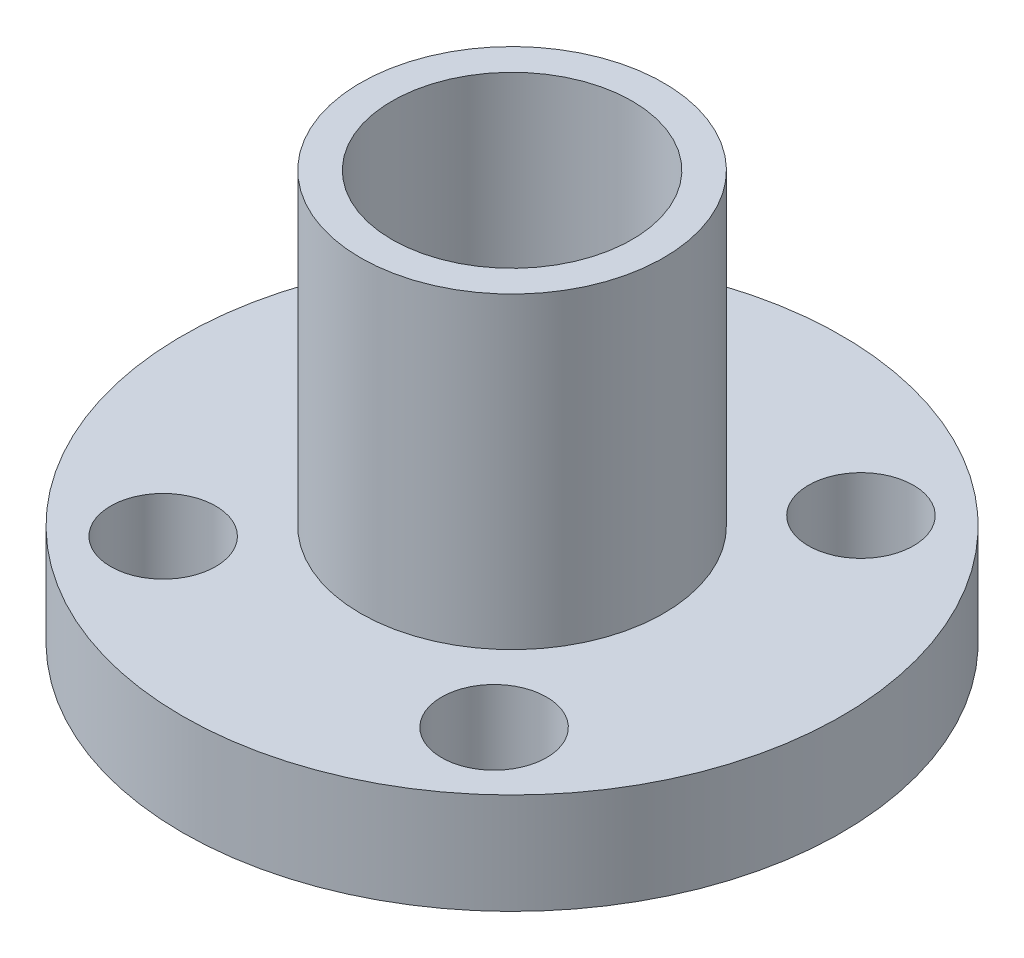
ISO-10303-21;
HEADER;
FILE_DESCRIPTION(('STEP AP214'),'2;1');
FILE_NAME('part.step','',(''),(''),'','','');
FILE_SCHEMA(('AUTOMOTIVE_DESIGN { 1 0 10303 214 1 1 1 1 }'));
ENDSEC;
DATA;
#1=APPLICATION_CONTEXT('core data for automotive mechanical design processes');
#2=APPLICATION_PROTOCOL_DEFINITION('international standard','automotive_design',2000,#1);
#3=PRODUCT_CONTEXT('',#1,'mechanical');
#4=PRODUCT('Part','Part','',(#3));
#5=PRODUCT_RELATED_PRODUCT_CATEGORY('part','',(#4));
#6=PRODUCT_DEFINITION_FORMATION('','',#4);
#7=PRODUCT_DEFINITION_CONTEXT('part definition',#1,'design');
#8=PRODUCT_DEFINITION('design','',#6,#7);
#9=PRODUCT_DEFINITION_SHAPE('','',#8);
#10=(LENGTH_UNIT() NAMED_UNIT(*) SI_UNIT(.MILLI.,.METRE.));
#11=(NAMED_UNIT(*) PLANE_ANGLE_UNIT() SI_UNIT($,.RADIAN.));
#12=(NAMED_UNIT(*) SI_UNIT($,.STERADIAN.) SOLID_ANGLE_UNIT());
#13=UNCERTAINTY_MEASURE_WITH_UNIT(LENGTH_MEASURE(1.E-05),#10,'distance_accuracy_value','');
#14=(GEOMETRIC_REPRESENTATION_CONTEXT(3) GLOBAL_UNCERTAINTY_ASSIGNED_CONTEXT((#13)) GLOBAL_UNIT_ASSIGNED_CONTEXT((#10,
#11,#12)) REPRESENTATION_CONTEXT('',''));
#15=CARTESIAN_POINT('',(0.,0.,0.));
#16=DIRECTION('',(0.,0.,1.));
#17=DIRECTION('',(1.,0.,0.));
#18=AXIS2_PLACEMENT_3D('',#15,#16,#17);
#19=CARTESIAN_POINT('',(0.,3.36,0.));
#20=DIRECTION('',(0.,1.,0.));
#21=DIRECTION('',(0.,0.,1.));
#22=AXIS2_PLACEMENT_3D('',#19,#20,#21);
#23=PLANE('',#22);
#24=CARTESIAN_POINT('',(0.,3.36,0.));
#25=DIRECTION('',(0.,1.,0.));
#26=DIRECTION('',(0.,0.,1.));
#27=AXIS2_PLACEMENT_3D('',#24,#25,#26);
#28=CIRCLE('',#27,5.05);
#29=CARTESIAN_POINT('',(0.,3.36,5.05));
#30=VERTEX_POINT('',#29);
#31=EDGE_CURVE('E72',#30,#30,#28,.T.);
#32=ORIENTED_EDGE('',*,*,#31,.F.);
#33=EDGE_LOOP('',(#32));
#34=FACE_BOUND('',#33,.T.);
#35=CARTESIAN_POINT('',(5.51209355793703,3.36,6.11144210547307));
#36=DIRECTION('',(0.,1.,0.));
#37=DIRECTION('',(0.,0.,-1.));
#38=AXIS2_PLACEMENT_3D('',#35,#36,#37);
#39=CIRCLE('',#38,1.75);
#40=CARTESIAN_POINT('',(5.51209355793703,3.36,4.36144210547307));
#41=VERTEX_POINT('',#40);
#42=EDGE_CURVE('E57',#41,#41,#39,.T.);
#43=ORIENTED_EDGE('',*,*,#42,.F.);
#44=EDGE_LOOP('',(#43));
#45=FACE_BOUND('',#44,.T.);
#46=CARTESIAN_POINT('',(-5.51209355793703,3.36,6.11144210547307));
#47=DIRECTION('',(0.,1.,0.));
#48=DIRECTION('',(0.,0.,1.));
#49=AXIS2_PLACEMENT_3D('',#46,#47,#48);
#50=CIRCLE('',#49,1.75);
#51=CARTESIAN_POINT('',(-5.51209355793703,3.36,7.86144210547307));
#52=VERTEX_POINT('',#51);
#53=EDGE_CURVE('E46',#52,#52,#50,.T.);
#54=ORIENTED_EDGE('',*,*,#53,.F.);
#55=EDGE_LOOP('',(#54));
#56=FACE_BOUND('',#55,.T.);
#57=CARTESIAN_POINT('',(0.,3.36,0.));
#58=DIRECTION('',(0.,1.,0.));
#59=DIRECTION('',(0.,0.,1.));
#60=AXIS2_PLACEMENT_3D('',#57,#58,#59);
#61=CIRCLE('',#60,10.98);
#62=CARTESIAN_POINT('',(0.,3.36,10.98));
#63=VERTEX_POINT('',#62);
#64=EDGE_CURVE('E37',#63,#63,#61,.T.);
#65=ORIENTED_EDGE('',*,*,#64,.T.);
#66=EDGE_LOOP('',(#65));
#67=FACE_BOUND('',#66,.T.);
#68=CARTESIAN_POINT('',(-5.51209355793703,3.36,-6.11144210547307));
#69=DIRECTION('',(0.,1.,0.));
#70=DIRECTION('',(0.,0.,1.));
#71=AXIS2_PLACEMENT_3D('',#68,#69,#70);
#72=CIRCLE('',#71,1.75);
#73=CARTESIAN_POINT('',(-5.51209355793703,3.36,-4.36144210547307));
#74=VERTEX_POINT('',#73);
#75=EDGE_CURVE('E51',#74,#74,#72,.T.);
#76=ORIENTED_EDGE('',*,*,#75,.F.);
#77=EDGE_LOOP('',(#76));
#78=FACE_BOUND('',#77,.T.);
#79=CARTESIAN_POINT('',(5.51209355793703,3.36,-6.11144210547307));
#80=DIRECTION('',(0.,1.,0.));
#81=DIRECTION('',(0.,0.,-1.));
#82=AXIS2_PLACEMENT_3D('',#79,#80,#81);
#83=CIRCLE('',#82,1.75);
#84=CARTESIAN_POINT('',(5.51209355793703,3.36,-7.86144210547307));
#85=VERTEX_POINT('',#84);
#86=EDGE_CURVE('E63',#85,#85,#83,.T.);
#87=ORIENTED_EDGE('',*,*,#86,.F.);
#88=EDGE_LOOP('',(#87));
#89=FACE_BOUND('',#88,.T.);
#90=ADVANCED_FACE('F30',(#34,#45,#56,#67,#78,#89),#23,.T.);
#91=CARTESIAN_POINT('',(0.,0.,0.));
#92=DIRECTION('',(0.,1.,0.));
#93=DIRECTION('',(0.,0.,1.));
#94=AXIS2_PLACEMENT_3D('',#91,#92,#93);
#95=PLANE('',#94);
#96=CARTESIAN_POINT('',(0.,0.,0.));
#97=DIRECTION('',(0.,1.,0.));
#98=DIRECTION('',(0.,0.,1.));
#99=AXIS2_PLACEMENT_3D('',#96,#97,#98);
#100=CIRCLE('',#99,5.05);
#101=CARTESIAN_POINT('',(0.,0.,5.05));
#102=VERTEX_POINT('',#101);
#103=EDGE_CURVE('E10',#102,#102,#100,.F.);
#104=ORIENTED_EDGE('',*,*,#103,.F.);
#105=EDGE_LOOP('',(#104));
#106=FACE_BOUND('',#105,.T.);
#107=CARTESIAN_POINT('',(0.,0.,0.));
#108=DIRECTION('',(0.,1.,0.));
#109=DIRECTION('',(0.,0.,1.));
#110=AXIS2_PLACEMENT_3D('',#107,#108,#109);
#111=CIRCLE('',#110,10.98);
#112=CARTESIAN_POINT('',(0.,0.,10.98));
#113=VERTEX_POINT('',#112);
#114=EDGE_CURVE('E41',#113,#113,#111,.T.);
#115=ORIENTED_EDGE('',*,*,#114,.F.);
#116=EDGE_LOOP('',(#115));
#117=FACE_BOUND('',#116,.T.);
#118=CARTESIAN_POINT('',(-5.51209355793703,0.,6.11144210547307));
#119=DIRECTION('',(0.,1.,0.));
#120=DIRECTION('',(0.,0.,1.));
#121=AXIS2_PLACEMENT_3D('',#118,#119,#120);
#122=CIRCLE('',#121,1.75);
#123=CARTESIAN_POINT('',(-5.51209355793703,0.,7.86144210547307));
#124=VERTEX_POINT('',#123);
#125=EDGE_CURVE('E48',#124,#124,#122,.T.);
#126=ORIENTED_EDGE('',*,*,#125,.T.);
#127=EDGE_LOOP('',(#126));
#128=FACE_BOUND('',#127,.T.);
#129=CARTESIAN_POINT('',(-5.51209355793703,0.,-6.11144210547307));
#130=DIRECTION('',(0.,1.,0.));
#131=DIRECTION('',(0.,0.,1.));
#132=AXIS2_PLACEMENT_3D('',#129,#130,#131);
#133=CIRCLE('',#132,1.75);
#134=CARTESIAN_POINT('',(-5.51209355793703,0.,-4.36144210547307));
#135=VERTEX_POINT('',#134);
#136=EDGE_CURVE('E54',#135,#135,#133,.T.);
#137=ORIENTED_EDGE('',*,*,#136,.T.);
#138=EDGE_LOOP('',(#137));
#139=FACE_BOUND('',#138,.T.);
#140=CARTESIAN_POINT('',(5.51209355793703,0.,6.11144210547307));
#141=DIRECTION('',(0.,1.,0.));
#142=DIRECTION('',(0.,0.,-1.));
#143=AXIS2_PLACEMENT_3D('',#140,#141,#142);
#144=CIRCLE('',#143,1.75);
#145=CARTESIAN_POINT('',(5.51209355793703,0.,4.36144210547307));
#146=VERTEX_POINT('',#145);
#147=EDGE_CURVE('E60',#146,#146,#144,.T.);
#148=ORIENTED_EDGE('',*,*,#147,.T.);
#149=EDGE_LOOP('',(#148));
#150=FACE_BOUND('',#149,.T.);
#151=CARTESIAN_POINT('',(5.51209355793703,0.,-6.11144210547307));
#152=DIRECTION('',(0.,1.,0.));
#153=DIRECTION('',(0.,0.,-1.));
#154=AXIS2_PLACEMENT_3D('',#151,#152,#153);
#155=CIRCLE('',#154,1.75);
#156=CARTESIAN_POINT('',(5.51209355793703,0.,-7.86144210547307));
#157=VERTEX_POINT('',#156);
#158=EDGE_CURVE('E66',#157,#157,#155,.T.);
#159=ORIENTED_EDGE('',*,*,#158,.T.);
#160=EDGE_LOOP('',(#159));
#161=FACE_BOUND('',#160,.T.);
#162=ADVANCED_FACE('F112',(#106,#117,#128,#139,#150,#161),#95,.F.);
#163=CARTESIAN_POINT('',(0.,3.36,0.));
#164=DIRECTION('',(0.,-1.,0.));
#165=DIRECTION('',(0.,0.,-1.));
#166=AXIS2_PLACEMENT_3D('',#163,#164,#165);
#167=CYLINDRICAL_SURFACE('',#166,10.98);
#168=ORIENTED_EDGE('',*,*,#64,.F.);
#169=EDGE_LOOP('',(#168));
#170=FACE_BOUND('',#169,.T.);
#171=ORIENTED_EDGE('',*,*,#114,.T.);
#172=EDGE_LOOP('',(#171));
#173=FACE_BOUND('',#172,.T.);
#174=ADVANCED_FACE('F32',(#170,#173),#167,.T.);
#175=CARTESIAN_POINT('',(-5.51209355793703,3.36,6.11144210547307));
#176=DIRECTION('',(0.,-1.,0.));
#177=DIRECTION('',(0.,0.,-1.));
#178=AXIS2_PLACEMENT_3D('',#175,#176,#177);
#179=CYLINDRICAL_SURFACE('',#178,1.75);
#180=ORIENTED_EDGE('',*,*,#53,.T.);
#181=EDGE_LOOP('',(#180));
#182=FACE_BOUND('',#181,.T.);
#183=ORIENTED_EDGE('',*,*,#125,.F.);
#184=EDGE_LOOP('',(#183));
#185=FACE_BOUND('',#184,.T.);
#186=ADVANCED_FACE('F133',(#182,#185),#179,.F.);
#187=CARTESIAN_POINT('',(-5.51209355793703,3.36,-6.11144210547307));
#188=DIRECTION('',(0.,-1.,0.));
#189=DIRECTION('',(0.,0.,-1.));
#190=AXIS2_PLACEMENT_3D('',#187,#188,#189);
#191=CYLINDRICAL_SURFACE('',#190,1.75);
#192=ORIENTED_EDGE('',*,*,#75,.T.);
#193=EDGE_LOOP('',(#192));
#194=FACE_BOUND('',#193,.T.);
#195=ORIENTED_EDGE('',*,*,#136,.F.);
#196=EDGE_LOOP('',(#195));
#197=FACE_BOUND('',#196,.T.);
#198=ADVANCED_FACE('F139',(#194,#197),#191,.F.);
#199=CARTESIAN_POINT('',(5.51209355793703,3.36,6.11144210547307));
#200=DIRECTION('',(0.,-1.,0.));
#201=DIRECTION('',(0.,0.,-1.));
#202=AXIS2_PLACEMENT_3D('',#199,#200,#201);
#203=CYLINDRICAL_SURFACE('',#202,1.75);
#204=ORIENTED_EDGE('',*,*,#42,.T.);
#205=EDGE_LOOP('',(#204));
#206=FACE_BOUND('',#205,.T.);
#207=ORIENTED_EDGE('',*,*,#147,.F.);
#208=EDGE_LOOP('',(#207));
#209=FACE_BOUND('',#208,.T.);
#210=ADVANCED_FACE('F124',(#206,#209),#203,.F.);
#211=CARTESIAN_POINT('',(5.51209355793703,3.36,-6.11144210547307));
#212=DIRECTION('',(0.,-1.,0.));
#213=DIRECTION('',(0.,0.,-1.));
#214=AXIS2_PLACEMENT_3D('',#211,#212,#213);
#215=CYLINDRICAL_SURFACE('',#214,1.75);
#216=ORIENTED_EDGE('',*,*,#86,.T.);
#217=EDGE_LOOP('',(#216));
#218=FACE_BOUND('',#217,.T.);
#219=ORIENTED_EDGE('',*,*,#158,.F.);
#220=EDGE_LOOP('',(#219));
#221=FACE_BOUND('',#220,.T.);
#222=ADVANCED_FACE('F106',(#218,#221),#215,.F.);
#223=CARTESIAN_POINT('',(0.,13.62,0.));
#224=DIRECTION('',(0.,-1.,0.));
#225=DIRECTION('',(0.,0.,-1.));
#226=AXIS2_PLACEMENT_3D('',#223,#224,#225);
#227=CYLINDRICAL_SURFACE('',#226,5.05);
#228=CARTESIAN_POINT('',(0.,13.62,0.));
#229=DIRECTION('',(0.,1.,0.));
#230=DIRECTION('',(0.,0.,1.));
#231=AXIS2_PLACEMENT_3D('',#228,#229,#230);
#232=CIRCLE('',#231,5.05);
#233=CARTESIAN_POINT('',(0.,13.62,5.05));
#234=VERTEX_POINT('',#233);
#235=EDGE_CURVE('E69',#234,#234,#232,.T.);
#236=ORIENTED_EDGE('',*,*,#235,.F.);
#237=EDGE_LOOP('',(#236));
#238=FACE_BOUND('',#237,.T.);
#239=ORIENTED_EDGE('',*,*,#31,.T.);
#240=EDGE_LOOP('',(#239));
#241=FACE_BOUND('',#240,.T.);
#242=ADVANCED_FACE('F100',(#238,#241),#227,.T.);
#243=CARTESIAN_POINT('',(0.,13.62,0.));
#244=DIRECTION('',(0.,1.,0.));
#245=DIRECTION('',(0.,0.,1.));
#246=AXIS2_PLACEMENT_3D('',#243,#244,#245);
#247=PLANE('',#246);
#248=CARTESIAN_POINT('',(0.,13.62,0.));
#249=DIRECTION('',(0.,1.,0.));
#250=DIRECTION('',(0.,0.,1.));
#251=AXIS2_PLACEMENT_3D('',#248,#249,#250);
#252=CIRCLE('',#251,4.);
#253=CARTESIAN_POINT('',(0.,13.62,4.));
#254=VERTEX_POINT('',#253);
#255=EDGE_CURVE('E81',#254,#254,#252,.T.);
#256=ORIENTED_EDGE('',*,*,#255,.F.);
#257=EDGE_LOOP('',(#256));
#258=FACE_BOUND('',#257,.T.);
#259=ORIENTED_EDGE('',*,*,#235,.T.);
#260=EDGE_LOOP('',(#259));
#261=FACE_BOUND('',#260,.T.);
#262=ADVANCED_FACE('F96',(#258,#261),#247,.T.);
#263=CARTESIAN_POINT('',(0.,-1.38,0.));
#264=DIRECTION('',(0.,1.,0.));
#265=DIRECTION('',(0.,0.,1.));
#266=AXIS2_PLACEMENT_3D('',#263,#264,#265);
#267=CYLINDRICAL_SURFACE('',#266,5.05);
#268=CARTESIAN_POINT('',(0.,-1.38,0.));
#269=DIRECTION('',(0.,-1.,0.));
#270=DIRECTION('',(0.,0.,-1.));
#271=AXIS2_PLACEMENT_3D('',#268,#269,#270);
#272=CIRCLE('',#271,5.05);
#273=CARTESIAN_POINT('',(0.,-1.38,-5.05));
#274=VERTEX_POINT('',#273);
#275=EDGE_CURVE('E75',#274,#274,#272,.T.);
#276=ORIENTED_EDGE('',*,*,#275,.F.);
#277=EDGE_LOOP('',(#276));
#278=FACE_BOUND('',#277,.T.);
#279=ORIENTED_EDGE('',*,*,#103,.T.);
#280=EDGE_LOOP('',(#279));
#281=FACE_BOUND('',#280,.T.);
#282=ADVANCED_FACE('F99',(#278,#281),#267,.T.);
#283=CARTESIAN_POINT('',(0.,-1.38,0.));
#284=DIRECTION('',(0.,-1.,0.));
#285=DIRECTION('',(0.,0.,-1.));
#286=AXIS2_PLACEMENT_3D('',#283,#284,#285);
#287=PLANE('',#286);
#288=CARTESIAN_POINT('',(0.,-1.38,0.));
#289=DIRECTION('',(0.,1.,0.));
#290=DIRECTION('',(0.,0.,1.));
#291=AXIS2_PLACEMENT_3D('',#288,#289,#290);
#292=CIRCLE('',#291,4.);
#293=CARTESIAN_POINT('',(0.,-1.38,4.));
#294=VERTEX_POINT('',#293);
#295=EDGE_CURVE('E80',#294,#294,#292,.T.);
#296=ORIENTED_EDGE('',*,*,#295,.T.);
#297=EDGE_LOOP('',(#296));
#298=FACE_BOUND('',#297,.T.);
#299=ORIENTED_EDGE('',*,*,#275,.T.);
#300=EDGE_LOOP('',(#299));
#301=FACE_BOUND('',#300,.T.);
#302=ADVANCED_FACE('F87',(#298,#301),#287,.T.);
#303=CARTESIAN_POINT('',(0.,-1.38,0.));
#304=DIRECTION('',(0.,1.,0.));
#305=DIRECTION('',(0.,0.,1.));
#306=AXIS2_PLACEMENT_3D('',#303,#304,#305);
#307=CYLINDRICAL_SURFACE('',#306,4.);
#308=ORIENTED_EDGE('',*,*,#295,.F.);
#309=EDGE_LOOP('',(#308));
#310=FACE_BOUND('',#309,.T.);
#311=ORIENTED_EDGE('',*,*,#255,.T.);
#312=EDGE_LOOP('',(#311));
#313=FACE_BOUND('',#312,.T.);
#314=ADVANCED_FACE('F90',(#310,#313),#307,.F.);
#315=CLOSED_SHELL('',(#90,#162,#174,#186,#198,#210,#222,#242,#262,#282,#302,#314));
#316=MANIFOLD_SOLID_BREP('B2',#315);
#317=ADVANCED_BREP_SHAPE_REPRESENTATION('',(#18,#316),#14);
#318=SHAPE_DEFINITION_REPRESENTATION(#9,#317);
ENDSEC;
END-ISO-10303-21;
